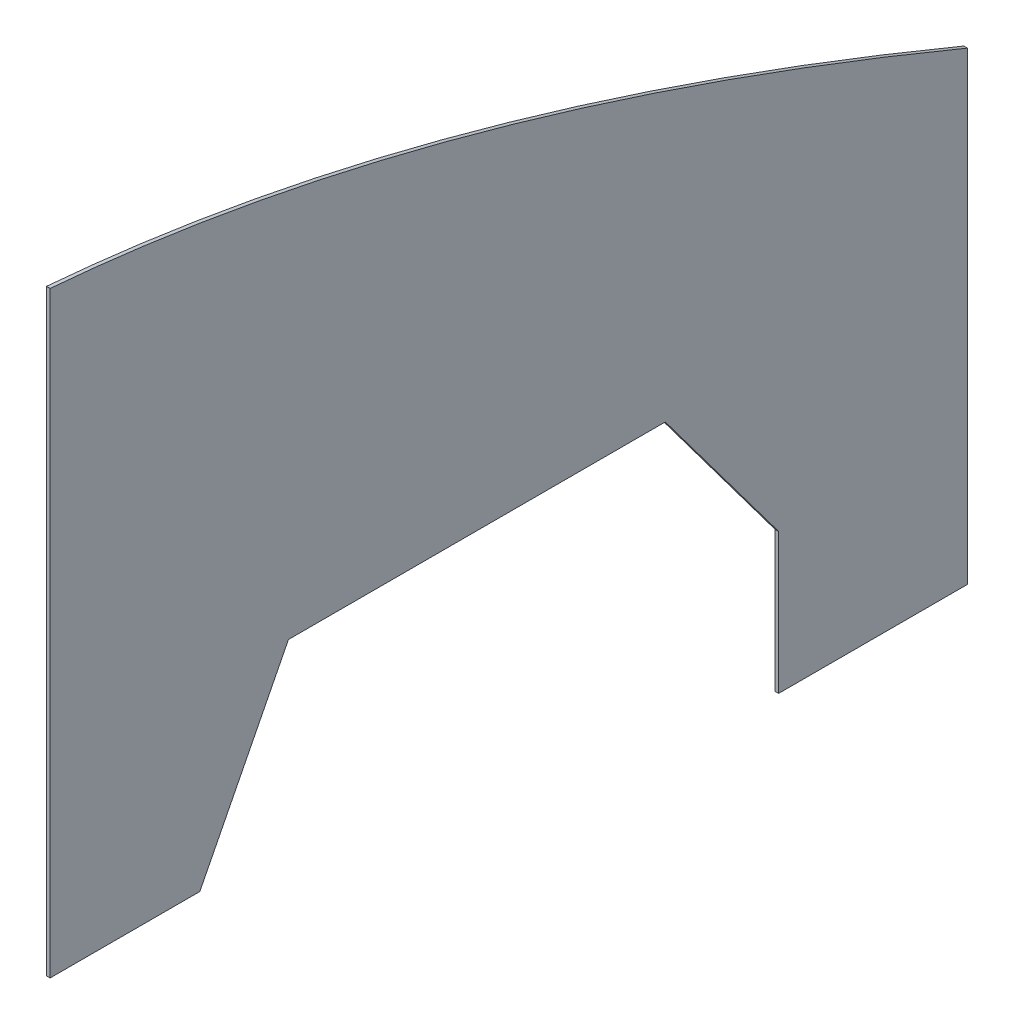
ISO-10303-21;
HEADER;
FILE_DESCRIPTION(('STEP AP214'),'2;1');
FILE_NAME('part.step','',(''),(''),'','','');
FILE_SCHEMA(('AUTOMOTIVE_DESIGN { 1 0 10303 214 1 1 1 1 }'));
ENDSEC;
DATA;
#1=APPLICATION_CONTEXT('core data for automotive mechanical design processes');
#2=APPLICATION_PROTOCOL_DEFINITION('international standard','automotive_design',2000,#1);
#3=PRODUCT_CONTEXT('',#1,'mechanical');
#4=PRODUCT('Part','Part','',(#3));
#5=PRODUCT_RELATED_PRODUCT_CATEGORY('part','',(#4));
#6=PRODUCT_DEFINITION_FORMATION('','',#4);
#7=PRODUCT_DEFINITION_CONTEXT('part definition',#1,'design');
#8=PRODUCT_DEFINITION('design','',#6,#7);
#9=PRODUCT_DEFINITION_SHAPE('','',#8);
#10=(LENGTH_UNIT() NAMED_UNIT(*) SI_UNIT(.MILLI.,.METRE.));
#11=(NAMED_UNIT(*) PLANE_ANGLE_UNIT() SI_UNIT($,.RADIAN.));
#12=(NAMED_UNIT(*) SI_UNIT($,.STERADIAN.) SOLID_ANGLE_UNIT());
#13=UNCERTAINTY_MEASURE_WITH_UNIT(LENGTH_MEASURE(1.E-05),#10,'distance_accuracy_value','');
#14=(GEOMETRIC_REPRESENTATION_CONTEXT(3) GLOBAL_UNCERTAINTY_ASSIGNED_CONTEXT((#13)) GLOBAL_UNIT_ASSIGNED_CONTEXT((#10,
#11,#12)) REPRESENTATION_CONTEXT('',''));
#15=CARTESIAN_POINT('',(0.,0.,0.));
#16=DIRECTION('',(0.,0.,1.));
#17=DIRECTION('',(1.,0.,0.));
#18=AXIS2_PLACEMENT_3D('',#15,#16,#17);
#19=CARTESIAN_POINT('',(2.,0.,-83.2461886134899));
#20=DIRECTION('',(0.,1.,0.));
#21=DIRECTION('',(0.,0.,1.));
#22=AXIS2_PLACEMENT_3D('',#19,#20,#21);
#23=PLANE('',#22);
#24=DIRECTION('',(0.,0.,-1.));
#25=VECTOR('',#24,1.);
#26=CARTESIAN_POINT('',(0.,0.,-83.2461886134899));
#27=LINE('',#26,#25);
#28=CARTESIAN_POINT('',(0.,0.,0.));
#29=VERTEX_POINT('',#28);
#30=CARTESIAN_POINT('',(0.,0.,-83.2461886134899));
#31=VERTEX_POINT('',#30);
#32=EDGE_CURVE('E190',#29,#31,#27,.T.);
#33=ORIENTED_EDGE('',*,*,#32,.T.);
#34=DIRECTION('',(-1.,0.,0.));
#35=VECTOR('',#34,1.);
#36=CARTESIAN_POINT('',(2.,0.,-83.2461886134899));
#37=LINE('',#36,#35);
#38=CARTESIAN_POINT('',(2.,0.,-83.2461886134899));
#39=VERTEX_POINT('',#38);
#40=EDGE_CURVE('E11',#39,#31,#37,.T.);
#41=ORIENTED_EDGE('',*,*,#40,.F.);
#42=DIRECTION('',(0.,0.,-1.));
#43=VECTOR('',#42,1.);
#44=CARTESIAN_POINT('',(2.,0.,-83.2461886134899));
#45=LINE('',#44,#43);
#46=CARTESIAN_POINT('',(2.,0.,0.));
#47=VERTEX_POINT('',#46);
#48=EDGE_CURVE('E224',#47,#39,#45,.T.);
#49=ORIENTED_EDGE('',*,*,#48,.F.);
#50=DIRECTION('',(-1.,0.,0.));
#51=VECTOR('',#50,1.);
#52=CARTESIAN_POINT('',(2.,0.,0.));
#53=LINE('',#52,#51);
#54=EDGE_CURVE('E141',#47,#29,#53,.T.);
#55=ORIENTED_EDGE('',*,*,#54,.T.);
#56=EDGE_LOOP('',(#33,#41,#49,#55));
#57=FACE_BOUND('',#56,.T.);
#58=ADVANCED_FACE('F39',(#57),#23,.F.);
#59=CARTESIAN_POINT('',(2.,96.7,-132.5));
#60=DIRECTION('',(0.,0.45386393903972,0.891070998764604));
#61=DIRECTION('',(0.,-0.891070998764604,0.45386393903972));
#62=AXIS2_PLACEMENT_3D('',#59,#60,#61);
#63=PLANE('',#62);
#64=DIRECTION('',(0.,0.891070998764604,-0.45386393903972));
#65=VECTOR('',#64,1.);
#66=CARTESIAN_POINT('',(0.,96.7,-132.5));
#67=LINE('',#66,#65);
#68=CARTESIAN_POINT('',(0.,96.7,-132.5));
#69=VERTEX_POINT('',#68);
#70=EDGE_CURVE('E180',#31,#69,#67,.T.);
#71=ORIENTED_EDGE('',*,*,#70,.T.);
#72=DIRECTION('',(-1.,0.,0.));
#73=VECTOR('',#72,1.);
#74=CARTESIAN_POINT('',(2.,96.7,-132.5));
#75=LINE('',#74,#73);
#76=CARTESIAN_POINT('',(2.,96.7,-132.5));
#77=VERTEX_POINT('',#76);
#78=EDGE_CURVE('E48',#77,#69,#75,.T.);
#79=ORIENTED_EDGE('',*,*,#78,.F.);
#80=DIRECTION('',(0.,0.891070998764604,-0.45386393903972));
#81=VECTOR('',#80,1.);
#82=CARTESIAN_POINT('',(2.,96.7,-132.5));
#83=LINE('',#82,#81);
#84=EDGE_CURVE('E102',#39,#77,#83,.T.);
#85=ORIENTED_EDGE('',*,*,#84,.F.);
#86=ORIENTED_EDGE('',*,*,#40,.T.);
#87=EDGE_LOOP('',(#71,#79,#85,#86));
#88=FACE_BOUND('',#87,.T.);
#89=ADVANCED_FACE('F173',(#88),#63,.F.);
#90=CARTESIAN_POINT('',(2.,96.7,-132.5));
#91=DIRECTION('',(0.,1.,0.));
#92=DIRECTION('',(0.,0.,1.));
#93=AXIS2_PLACEMENT_3D('',#90,#91,#92);
#94=PLANE('',#93);
#95=DIRECTION('',(0.,0.,-1.));
#96=VECTOR('',#95,1.);
#97=CARTESIAN_POINT('',(0.,96.7,-132.5));
#98=LINE('',#97,#96);
#99=CARTESIAN_POINT('',(0.,96.7,-342.));
#100=VERTEX_POINT('',#99);
#101=EDGE_CURVE('E189',#69,#100,#98,.T.);
#102=ORIENTED_EDGE('',*,*,#101,.T.);
#103=DIRECTION('',(-1.,0.,0.));
#104=VECTOR('',#103,1.);
#105=CARTESIAN_POINT('',(2.,96.7,-342.));
#106=LINE('',#105,#104);
#107=CARTESIAN_POINT('',(2.,96.7,-342.));
#108=VERTEX_POINT('',#107);
#109=EDGE_CURVE('E196',#108,#100,#106,.T.);
#110=ORIENTED_EDGE('',*,*,#109,.F.);
#111=DIRECTION('',(0.,0.,-1.));
#112=VECTOR('',#111,1.);
#113=CARTESIAN_POINT('',(2.,96.7,-132.5));
#114=LINE('',#113,#112);
#115=EDGE_CURVE('E194',#77,#108,#114,.T.);
#116=ORIENTED_EDGE('',*,*,#115,.F.);
#117=ORIENTED_EDGE('',*,*,#78,.T.);
#118=EDGE_LOOP('',(#102,#110,#116,#117));
#119=FACE_BOUND('',#118,.T.);
#120=ADVANCED_FACE('F170',(#119),#94,.F.);
#121=CARTESIAN_POINT('',(2.,96.7,-342.));
#122=DIRECTION('',(0.,0.599086715312711,-0.800684149671908));
#123=DIRECTION('',(0.,0.800684149671908,0.599086715312711));
#124=AXIS2_PLACEMENT_3D('',#121,#122,#123);
#125=PLANE('',#124);
#126=DIRECTION('',(0.,-0.800684149671908,-0.599086715312711));
#127=VECTOR('',#126,1.);
#128=CARTESIAN_POINT('',(0.,96.7,-342.));
#129=LINE('',#128,#127);
#130=CARTESIAN_POINT('',(0.,12.5,-405.));
#131=VERTEX_POINT('',#130);
#132=EDGE_CURVE('E200',#100,#131,#129,.T.);
#133=ORIENTED_EDGE('',*,*,#132,.T.);
#134=DIRECTION('',(-1.,0.,0.));
#135=VECTOR('',#134,1.);
#136=CARTESIAN_POINT('',(2.,12.5,-405.));
#137=LINE('',#136,#135);
#138=CARTESIAN_POINT('',(2.,12.5,-405.));
#139=VERTEX_POINT('',#138);
#140=EDGE_CURVE('E235',#139,#131,#137,.T.);
#141=ORIENTED_EDGE('',*,*,#140,.F.);
#142=DIRECTION('',(0.,-0.800684149671908,-0.599086715312711));
#143=VECTOR('',#142,1.);
#144=CARTESIAN_POINT('',(2.,96.7,-342.));
#145=LINE('',#144,#143);
#146=EDGE_CURVE('E242',#108,#139,#145,.T.);
#147=ORIENTED_EDGE('',*,*,#146,.F.);
#148=ORIENTED_EDGE('',*,*,#109,.T.);
#149=EDGE_LOOP('',(#133,#141,#147,#148));
#150=FACE_BOUND('',#149,.T.);
#151=ADVANCED_FACE('F166',(#150),#125,.F.);
#152=CARTESIAN_POINT('',(2.,-65.5,-405.));
#153=DIRECTION('',(0.,0.,-1.));
#154=DIRECTION('',(-1.,0.,0.));
#155=AXIS2_PLACEMENT_3D('',#152,#153,#154);
#156=PLANE('',#155);
#157=DIRECTION('',(0.,-1.,0.));
#158=VECTOR('',#157,1.);
#159=CARTESIAN_POINT('',(0.,-65.5,-405.));
#160=LINE('',#159,#158);
#161=CARTESIAN_POINT('',(0.,-65.5,-405.));
#162=VERTEX_POINT('',#161);
#163=EDGE_CURVE('E204',#131,#162,#160,.T.);
#164=ORIENTED_EDGE('',*,*,#163,.T.);
#165=DIRECTION('',(-1.,0.,0.));
#166=VECTOR('',#165,1.);
#167=CARTESIAN_POINT('',(2.,-65.5,-405.));
#168=LINE('',#167,#166);
#169=CARTESIAN_POINT('',(2.,-65.5,-405.));
#170=VERTEX_POINT('',#169);
#171=EDGE_CURVE('E231',#170,#162,#168,.T.);
#172=ORIENTED_EDGE('',*,*,#171,.F.);
#173=DIRECTION('',(0.,-1.,0.));
#174=VECTOR('',#173,1.);
#175=CARTESIAN_POINT('',(2.,-65.5,-405.));
#176=LINE('',#175,#174);
#177=EDGE_CURVE('E245',#139,#170,#176,.T.);
#178=ORIENTED_EDGE('',*,*,#177,.F.);
#179=ORIENTED_EDGE('',*,*,#140,.T.);
#180=EDGE_LOOP('',(#164,#172,#178,#179));
#181=FACE_BOUND('',#180,.T.);
#182=ADVANCED_FACE('F162',(#181),#156,.F.);
#183=CARTESIAN_POINT('',(2.,-65.5,-510.));
#184=DIRECTION('',(0.,1.,0.));
#185=DIRECTION('',(0.,0.,1.));
#186=AXIS2_PLACEMENT_3D('',#183,#184,#185);
#187=PLANE('',#186);
#188=DIRECTION('',(0.,0.,-1.));
#189=VECTOR('',#188,1.);
#190=CARTESIAN_POINT('',(0.,-65.5,-510.));
#191=LINE('',#190,#189);
#192=CARTESIAN_POINT('',(0.,-65.5,-510.));
#193=VERTEX_POINT('',#192);
#194=EDGE_CURVE('E209',#162,#193,#191,.T.);
#195=ORIENTED_EDGE('',*,*,#194,.T.);
#196=DIRECTION('',(-1.,0.,0.));
#197=VECTOR('',#196,1.);
#198=CARTESIAN_POINT('',(2.,-65.5,-510.));
#199=LINE('',#198,#197);
#200=CARTESIAN_POINT('',(2.,-65.5,-510.));
#201=VERTEX_POINT('',#200);
#202=EDGE_CURVE('E134',#201,#193,#199,.T.);
#203=ORIENTED_EDGE('',*,*,#202,.F.);
#204=DIRECTION('',(0.,0.,-1.));
#205=VECTOR('',#204,1.);
#206=CARTESIAN_POINT('',(2.,-65.5,-510.));
#207=LINE('',#206,#205);
#208=EDGE_CURVE('E124',#170,#201,#207,.T.);
#209=ORIENTED_EDGE('',*,*,#208,.F.);
#210=ORIENTED_EDGE('',*,*,#171,.T.);
#211=EDGE_LOOP('',(#195,#203,#209,#210));
#212=FACE_BOUND('',#211,.T.);
#213=ADVANCED_FACE('F159',(#212),#187,.F.);
#214=CARTESIAN_POINT('',(2.,192.7,-510.));
#215=DIRECTION('',(0.,0.,1.));
#216=DIRECTION('',(1.,0.,0.));
#217=AXIS2_PLACEMENT_3D('',#214,#215,#216);
#218=PLANE('',#217);
#219=DIRECTION('',(0.,1.,0.));
#220=VECTOR('',#219,1.);
#221=CARTESIAN_POINT('',(0.,192.7,-510.));
#222=LINE('',#221,#220);
#223=CARTESIAN_POINT('',(0.,192.7,-510.));
#224=VERTEX_POINT('',#223);
#225=EDGE_CURVE('E132',#193,#224,#222,.T.);
#226=ORIENTED_EDGE('',*,*,#225,.T.);
#227=DIRECTION('',(-1.,0.,0.));
#228=VECTOR('',#227,1.);
#229=CARTESIAN_POINT('',(2.,192.7,-510.));
#230=LINE('',#229,#228);
#231=CARTESIAN_POINT('',(2.,192.7,-510.));
#232=VERTEX_POINT('',#231);
#233=EDGE_CURVE('E130',#232,#224,#230,.T.);
#234=ORIENTED_EDGE('',*,*,#233,.F.);
#235=DIRECTION('',(0.,1.,0.));
#236=VECTOR('',#235,1.);
#237=CARTESIAN_POINT('',(2.,0.,-510.));
#238=LINE('',#237,#236);
#239=EDGE_CURVE('E118',#201,#232,#238,.T.);
#240=ORIENTED_EDGE('',*,*,#239,.F.);
#241=ORIENTED_EDGE('',*,*,#202,.T.);
#242=EDGE_LOOP('',(#226,#234,#240,#241));
#243=FACE_BOUND('',#242,.T.);
#244=ADVANCED_FACE('F131',(#243),#218,.F.);
#245=CARTESIAN_POINT('',(2.,192.7,-510.));
#246=CARTESIAN_POINT('',(2.,314.031089263005,-217.95996245899));
#247=CARTESIAN_POINT('',(2.,332.,0.));
#248=B_SPLINE_CURVE_WITH_KNOTS('',2,(#245,#246,#247),.UNSPECIFIED.,.F.,.F.,(3,3),(0.,1.),.UNSPECIFIED.);
#249=DIRECTION('',(-1.,0.,0.));
#250=VECTOR('',#249,1.);
#251=SURFACE_OF_LINEAR_EXTRUSION('',#248,#250);
#252=CARTESIAN_POINT('',(0.,192.7,-510.));
#253=CARTESIAN_POINT('',(0.,314.031089263005,-217.95996245899));
#254=CARTESIAN_POINT('',(0.,332.,0.));
#255=B_SPLINE_CURVE_WITH_KNOTS('',2,(#252,#253,#254),.UNSPECIFIED.,.F.,.F.,(3,3),(0.,1.),.UNSPECIFIED.);
#256=CARTESIAN_POINT('',(0.,332.,0.));
#257=VERTEX_POINT('',#256);
#258=EDGE_CURVE('E88',#224,#257,#255,.T.);
#259=ORIENTED_EDGE('',*,*,#258,.T.);
#260=DIRECTION('',(-1.,0.,0.));
#261=VECTOR('',#260,1.);
#262=CARTESIAN_POINT('',(2.,332.,0.));
#263=LINE('',#262,#261);
#264=CARTESIAN_POINT('',(2.,332.,0.));
#265=VERTEX_POINT('',#264);
#266=EDGE_CURVE('E135',#265,#257,#263,.T.);
#267=ORIENTED_EDGE('',*,*,#266,.F.);
#268=EDGE_CURVE('E122',#232,#265,#248,.T.);
#269=ORIENTED_EDGE('',*,*,#268,.F.);
#270=ORIENTED_EDGE('',*,*,#233,.T.);
#271=EDGE_LOOP('',(#259,#267,#269,#270));
#272=FACE_BOUND('',#271,.T.);
#273=ADVANCED_FACE('F137',(#272),#251,.F.);
#274=CARTESIAN_POINT('',(2.,0.,0.));
#275=DIRECTION('',(0.,0.,-1.));
#276=DIRECTION('',(-1.,0.,0.));
#277=AXIS2_PLACEMENT_3D('',#274,#275,#276);
#278=PLANE('',#277);
#279=DIRECTION('',(0.,-1.,0.));
#280=VECTOR('',#279,1.);
#281=CARTESIAN_POINT('',(0.,0.,0.));
#282=LINE('',#281,#280);
#283=EDGE_CURVE('E94',#257,#29,#282,.T.);
#284=ORIENTED_EDGE('',*,*,#283,.T.);
#285=ORIENTED_EDGE('',*,*,#54,.F.);
#286=DIRECTION('',(0.,-1.,0.));
#287=VECTOR('',#286,1.);
#288=CARTESIAN_POINT('',(2.,0.,0.));
#289=LINE('',#288,#287);
#290=EDGE_CURVE('E56',#265,#47,#289,.T.);
#291=ORIENTED_EDGE('',*,*,#290,.F.);
#292=ORIENTED_EDGE('',*,*,#266,.T.);
#293=EDGE_LOOP('',(#284,#285,#291,#292));
#294=FACE_BOUND('',#293,.T.);
#295=ADVANCED_FACE('F155',(#294),#278,.F.);
#296=CARTESIAN_POINT('',(2.,288.190544631502,-236.479981229495));
#297=DIRECTION('',(1.,0.,0.));
#298=DIRECTION('',(0.,0.,-1.));
#299=AXIS2_PLACEMENT_3D('',#296,#297,#298);
#300=PLANE('',#299);
#301=ORIENTED_EDGE('',*,*,#48,.T.);
#302=ORIENTED_EDGE('',*,*,#84,.T.);
#303=ORIENTED_EDGE('',*,*,#115,.T.);
#304=ORIENTED_EDGE('',*,*,#146,.T.);
#305=ORIENTED_EDGE('',*,*,#177,.T.);
#306=ORIENTED_EDGE('',*,*,#208,.T.);
#307=ORIENTED_EDGE('',*,*,#239,.T.);
#308=ORIENTED_EDGE('',*,*,#268,.T.);
#309=ORIENTED_EDGE('',*,*,#290,.T.);
#310=EDGE_LOOP('',(#301,#302,#303,#304,#305,#306,#307,#308,#309));
#311=FACE_BOUND('',#310,.T.);
#312=ADVANCED_FACE('F120',(#311),#300,.T.);
#313=CARTESIAN_POINT('',(0.,288.190544631502,-236.479981229495));
#314=DIRECTION('',(1.,0.,0.));
#315=DIRECTION('',(0.,0.,-1.));
#316=AXIS2_PLACEMENT_3D('',#313,#314,#315);
#317=PLANE('',#316);
#318=ORIENTED_EDGE('',*,*,#32,.F.);
#319=ORIENTED_EDGE('',*,*,#283,.F.);
#320=ORIENTED_EDGE('',*,*,#258,.F.);
#321=ORIENTED_EDGE('',*,*,#225,.F.);
#322=ORIENTED_EDGE('',*,*,#194,.F.);
#323=ORIENTED_EDGE('',*,*,#163,.F.);
#324=ORIENTED_EDGE('',*,*,#132,.F.);
#325=ORIENTED_EDGE('',*,*,#101,.F.);
#326=ORIENTED_EDGE('',*,*,#70,.F.);
#327=EDGE_LOOP('',(#318,#319,#320,#321,#322,#323,#324,#325,#326));
#328=FACE_BOUND('',#327,.T.);
#329=ADVANCED_FACE('F198',(#328),#317,.F.);
#330=CLOSED_SHELL('',(#58,#89,#120,#151,#182,#213,#244,#273,#295,#312,#329));
#331=MANIFOLD_SOLID_BREP('B2',#330);
#332=ADVANCED_BREP_SHAPE_REPRESENTATION('',(#18,#331),#14);
#333=SHAPE_DEFINITION_REPRESENTATION(#9,#332);
ENDSEC;
END-ISO-10303-21;
